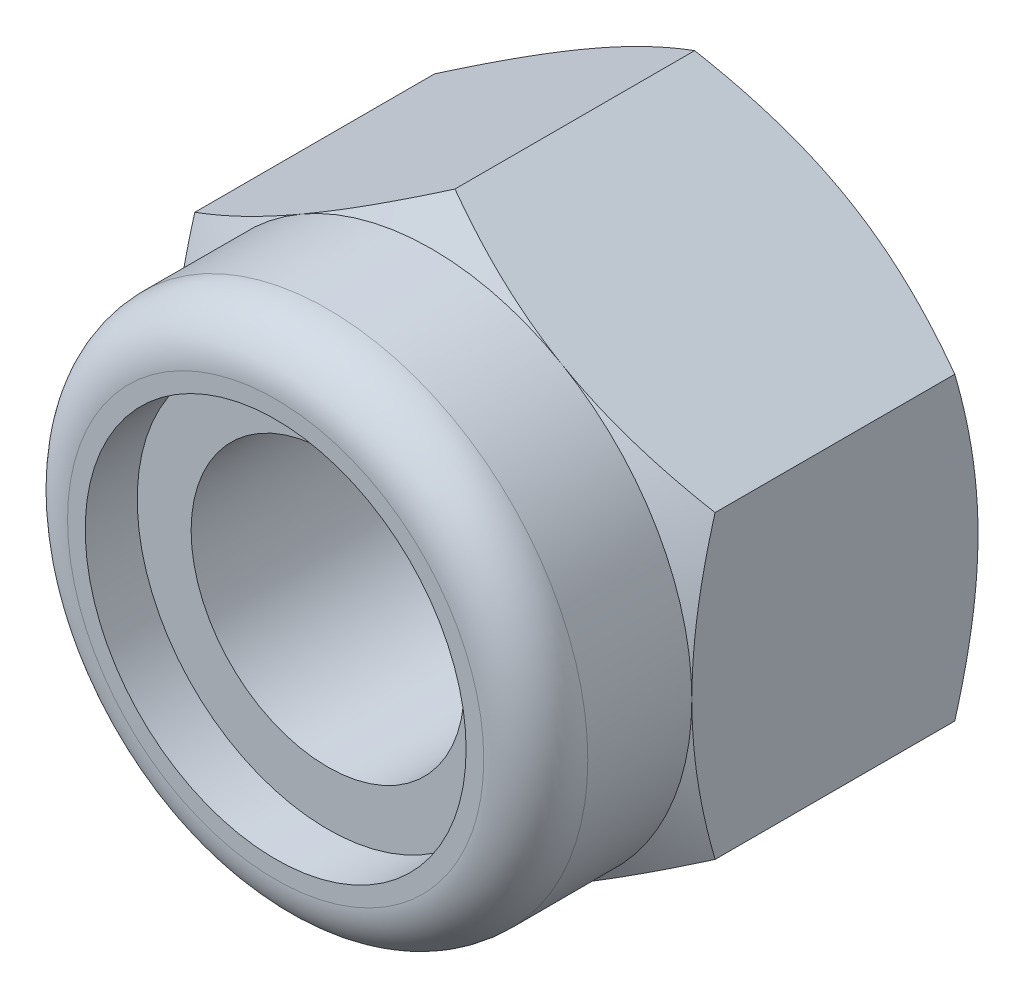
ISO-10303-21;
HEADER;
FILE_DESCRIPTION(('STEP AP214'),'2;1');
FILE_NAME('part.step','',(''),(''),'','','');
FILE_SCHEMA(('AUTOMOTIVE_DESIGN { 1 0 10303 214 1 1 1 1 }'));
ENDSEC;
DATA;
#1=APPLICATION_CONTEXT('core data for automotive mechanical design processes');
#2=APPLICATION_PROTOCOL_DEFINITION('international standard','automotive_design',2000,#1);
#3=PRODUCT_CONTEXT('',#1,'mechanical');
#4=PRODUCT('Part','Part','',(#3));
#5=PRODUCT_RELATED_PRODUCT_CATEGORY('part','',(#4));
#6=PRODUCT_DEFINITION_FORMATION('','',#4);
#7=PRODUCT_DEFINITION_CONTEXT('part definition',#1,'design');
#8=PRODUCT_DEFINITION('design','',#6,#7);
#9=PRODUCT_DEFINITION_SHAPE('','',#8);
#10=(LENGTH_UNIT() NAMED_UNIT(*) SI_UNIT(.MILLI.,.METRE.));
#11=(NAMED_UNIT(*) PLANE_ANGLE_UNIT() SI_UNIT($,.RADIAN.));
#12=(NAMED_UNIT(*) SI_UNIT($,.STERADIAN.) SOLID_ANGLE_UNIT());
#13=UNCERTAINTY_MEASURE_WITH_UNIT(LENGTH_MEASURE(1.E-05),#10,'distance_accuracy_value','');
#14=(GEOMETRIC_REPRESENTATION_CONTEXT(3) GLOBAL_UNCERTAINTY_ASSIGNED_CONTEXT((#13)) GLOBAL_UNIT_ASSIGNED_CONTEXT((#10,
#11,#12)) REPRESENTATION_CONTEXT('',''));
#15=CARTESIAN_POINT('',(0.,0.,0.));
#16=DIRECTION('',(0.,0.,1.));
#17=DIRECTION('',(1.,0.,0.));
#18=AXIS2_PLACEMENT_3D('',#15,#16,#17);
#19=CARTESIAN_POINT('',(0.,0.,-4.4));
#20=DIRECTION('',(0.,0.,1.));
#21=DIRECTION('',(1.,0.,0.));
#22=AXIS2_PLACEMENT_3D('',#19,#20,#21);
#23=CYLINDRICAL_SURFACE('',#22,2.1);
#24=CARTESIAN_POINT('',(0.,0.,1.6));
#25=DIRECTION('',(0.,0.,1.));
#26=DIRECTION('',(1.,0.,0.));
#27=AXIS2_PLACEMENT_3D('',#24,#25,#26);
#28=CIRCLE('',#27,2.1);
#29=CARTESIAN_POINT('',(2.1,0.,1.6));
#30=VERTEX_POINT('',#29);
#31=EDGE_CURVE('E272',#30,#30,#28,.T.);
#32=ORIENTED_EDGE('',*,*,#31,.T.);
#33=EDGE_LOOP('',(#32));
#34=FACE_BOUND('',#33,.T.);
#35=CARTESIAN_POINT('',(0.,0.,-4.09451698471612));
#36=DIRECTION('',(0.,0.,-1.));
#37=DIRECTION('',(-1.,0.,0.));
#38=AXIS2_PLACEMENT_3D('',#35,#36,#37);
#39=CIRCLE('',#38,2.1);
#40=CARTESIAN_POINT('',(-2.1,0.,-4.09451698471612));
#41=VERTEX_POINT('',#40);
#42=EDGE_CURVE('E39',#41,#41,#39,.F.);
#43=ORIENTED_EDGE('',*,*,#42,.F.);
#44=EDGE_LOOP('',(#43));
#45=FACE_BOUND('',#44,.T.);
#46=ADVANCED_FACE('F34',(#34,#45),#23,.F.);
#47=CARTESIAN_POINT('',(0.,4.61880215351701,-4.4));
#48=DIRECTION('',(0.,0.,-1.));
#49=DIRECTION('',(-1.,0.,0.));
#50=AXIS2_PLACEMENT_3D('',#47,#48,#49);
#51=PLANE('',#50);
#52=CARTESIAN_POINT('',(0.,0.,-4.4));
#53=DIRECTION('',(0.,0.,-1.));
#54=DIRECTION('',(-1.,0.,0.));
#55=AXIS2_PLACEMENT_3D('',#52,#53,#54);
#56=CIRCLE('',#55,4.);
#57=CARTESIAN_POINT('',(-4.,0.,-4.4));
#58=VERTEX_POINT('',#57);
#59=CARTESIAN_POINT('',(-2.,-3.46410161513775,-4.4));
#60=VERTEX_POINT('',#59);
#61=EDGE_CURVE('E144',#58,#60,#56,.F.);
#62=ORIENTED_EDGE('',*,*,#61,.F.);
#63=CARTESIAN_POINT('',(-2.,3.46410161513775,-4.4));
#64=VERTEX_POINT('',#63);
#65=EDGE_CURVE('E234',#64,#58,#56,.F.);
#66=ORIENTED_EDGE('',*,*,#65,.F.);
#67=CARTESIAN_POINT('',(2.,3.46410161513775,-4.4));
#68=VERTEX_POINT('',#67);
#69=EDGE_CURVE('E249',#68,#64,#56,.F.);
#70=ORIENTED_EDGE('',*,*,#69,.F.);
#71=CARTESIAN_POINT('',(0.,0.,-4.4));
#72=DIRECTION('',(0.,0.,1.));
#73=DIRECTION('',(1.,0.,0.));
#74=AXIS2_PLACEMENT_3D('',#71,#72,#73);
#75=CIRCLE('',#74,4.);
#76=CARTESIAN_POINT('',(4.,0.,-4.4));
#77=VERTEX_POINT('',#76);
#78=EDGE_CURVE('E206',#77,#68,#75,.T.);
#79=ORIENTED_EDGE('',*,*,#78,.F.);
#80=CARTESIAN_POINT('',(2.,-3.46410161513775,-4.4));
#81=VERTEX_POINT('',#80);
#82=EDGE_CURVE('E403',#81,#77,#56,.F.);
#83=ORIENTED_EDGE('',*,*,#82,.F.);
#84=EDGE_CURVE('E321',#60,#81,#56,.F.);
#85=ORIENTED_EDGE('',*,*,#84,.F.);
#86=EDGE_LOOP('',(#62,#66,#70,#79,#83,#85));
#87=FACE_BOUND('',#86,.T.);
#88=CARTESIAN_POINT('',(0.,0.,-4.4));
#89=DIRECTION('',(0.,0.,-1.));
#90=DIRECTION('',(-1.,0.,0.));
#91=AXIS2_PLACEMENT_3D('',#88,#89,#90);
#92=CIRCLE('',#91,2.5);
#93=CARTESIAN_POINT('',(-2.5,0.,-4.4));
#94=VERTEX_POINT('',#93);
#95=EDGE_CURVE('E250',#94,#94,#92,.F.);
#96=ORIENTED_EDGE('',*,*,#95,.T.);
#97=EDGE_LOOP('',(#96));
#98=FACE_BOUND('',#97,.T.);
#99=ADVANCED_FACE('F214',(#87,#98),#51,.T.);
#100=CARTESIAN_POINT('',(0.,4.61880215351701,-4.4));
#101=DIRECTION('',(-0.500000000000001,0.866025403784438,0.));
#102=DIRECTION('',(-0.866025403784438,-0.500000000000001,0.));
#103=AXIS2_PLACEMENT_3D('',#100,#101,#102);
#104=PLANE('',#103);
#105=DIRECTION('',(0.,0.,1.));
#106=VECTOR('',#105,1.);
#107=CARTESIAN_POINT('',(-4.,2.3094010767585,-4.4));
#108=LINE('',#107,#106);
#109=CARTESIAN_POINT('',(-4.,2.30940107675851,-4.04273441009183));
#110=VERTEX_POINT('',#109);
#111=CARTESIAN_POINT('',(-4.,2.3094010767585,-0.357265589908164));
#112=VERTEX_POINT('',#111);
#113=EDGE_CURVE('E245',#110,#112,#108,.T.);
#114=ORIENTED_EDGE('',*,*,#113,.T.);
#115=CARTESIAN_POINT('',(-4.0002,2.30928560670466,-0.357332259074767));
#116=CARTESIAN_POINT('',(-3.82442084967677,2.4107717464617,-0.298717873648283));
#117=CARTESIAN_POINT('',(-3.64712438367362,2.51313390883499,-0.245410321462263));
#118=CARTESIAN_POINT('',(-3.28946140682429,2.71963072479811,-0.152361670746403));
#119=CARTESIAN_POINT('',(-3.10908854102985,2.82376904741904,-0.112653489029704));
#120=CARTESIAN_POINT('',(-2.75057818129721,3.03075510011795,-0.0508422152802782));
#121=CARTESIAN_POINT('',(-2.57249584706486,3.13357098372492,-0.0283277315228881));
#122=CARTESIAN_POINT('',(-2.21549328283349,3.33968651028528,-0.001450623146581));
#123=CARTESIAN_POINT('',(-2.0365743503559,3.44298540411434,0.00293425857305767));
#124=CARTESIAN_POINT('',(-1.70225715780327,3.63600352522932,-0.00619007293996943));
#125=CARTESIAN_POINT('',(-1.54680884001293,3.72575165335065,-0.0174589539879935));
#126=CARTESIAN_POINT('',(-1.23692494436494,3.90466320392054,-0.0531739907981931));
#127=CARTESIAN_POINT('',(-1.08249043825587,3.99382600759478,-0.0776323457115336));
#128=CARTESIAN_POINT('',(-0.771967672225422,4.17310641015197,-0.138776064919291));
#129=CARTESIAN_POINT('',(-0.615918711936898,4.26320131938131,-0.175720603654865));
#130=CARTESIAN_POINT('',(-0.306148164596161,4.44204742827551,-0.259570072548029));
#131=CARTESIAN_POINT('',(-0.152422609226221,4.53080091904966,-0.306455302212742));
#132=CARTESIAN_POINT('',(0.000199999999999515,4.61891762357085,-0.35733225907477));
#133=B_SPLINE_CURVE_WITH_KNOTS('',3,(#115,#116,#117,#118,#119,#120,#121,#122,#123,#124,#125,
#126,#127,#128,#129,#130,#131,#132),.UNSPECIFIED.,.F.,.F.,(4,2,2,2,2,2,2,2,4),(0.,
0.634047835695966,1.26961969224543,1.88946157213122,2.50854226669297,3.04757825393386,
3.58711366126904,4.13861653143764,4.68903648037743),.UNSPECIFIED.);
#134=CARTESIAN_POINT('',(-2.,3.46410161513775,0.));
#135=VERTEX_POINT('',#134);
#136=EDGE_CURVE('E59',#112,#135,#133,.T.);
#137=ORIENTED_EDGE('',*,*,#136,.T.);
#138=CARTESIAN_POINT('',(0.,4.61880215351701,-0.357265589908166));
#139=VERTEX_POINT('',#138);
#140=EDGE_CURVE('E197',#135,#139,#133,.T.);
#141=ORIENTED_EDGE('',*,*,#140,.T.);
#142=DIRECTION('',(0.,0.,1.));
#143=VECTOR('',#142,1.);
#144=CARTESIAN_POINT('',(0.,4.61880215351701,-4.4));
#145=LINE('',#144,#143);
#146=CARTESIAN_POINT('',(0.,4.61880215351701,-4.04273441009183));
#147=VERTEX_POINT('',#146);
#148=EDGE_CURVE('E231',#147,#139,#145,.T.);
#149=ORIENTED_EDGE('',*,*,#148,.F.);
#150=CARTESIAN_POINT('',(-4.0002,2.30928560670466,-4.04266774092523));
#151=CARTESIAN_POINT('',(-3.82442084967677,2.4107717464617,-4.10128212635172));
#152=CARTESIAN_POINT('',(-3.64712438367362,2.51313390883499,-4.15458967853774));
#153=CARTESIAN_POINT('',(-3.28946140682429,2.71963072479811,-4.2476383292536));
#154=CARTESIAN_POINT('',(-3.10908854102985,2.82376904741904,-4.2873465109703));
#155=CARTESIAN_POINT('',(-2.75057818129721,3.03075510011795,-4.34915778471972));
#156=CARTESIAN_POINT('',(-2.57249584706486,3.13357098372492,-4.37167226847711));
#157=CARTESIAN_POINT('',(-2.21549328283349,3.33968651028528,-4.39854937685342));
#158=CARTESIAN_POINT('',(-2.0365743503559,3.44298540411434,-4.40293425857306));
#159=CARTESIAN_POINT('',(-1.70225715780327,3.63600352522932,-4.39380992706003));
#160=CARTESIAN_POINT('',(-1.54680884001293,3.72575165335065,-4.38254104601201));
#161=CARTESIAN_POINT('',(-1.23692494436494,3.90466320392054,-4.34682600920181));
#162=CARTESIAN_POINT('',(-1.08249043825587,3.99382600759479,-4.32236765428847));
#163=CARTESIAN_POINT('',(-0.771967672225422,4.17310641015197,-4.26122393508071));
#164=CARTESIAN_POINT('',(-0.615918711936898,4.26320131938131,-4.22427939634514));
#165=CARTESIAN_POINT('',(-0.306148164596161,4.44204742827551,-4.14042992745197));
#166=CARTESIAN_POINT('',(-0.152422609226221,4.53080091904966,-4.09354469778726));
#167=CARTESIAN_POINT('',(0.00019999999999951,4.61891762357085,-4.04266774092523));
#168=B_SPLINE_CURVE_WITH_KNOTS('',3,(#150,#151,#152,#153,#154,#155,#156,#157,#158,#159,#160,
#161,#162,#163,#164,#165,#166,#167),.UNSPECIFIED.,.F.,.F.,(4,2,2,2,2,2,2,2,4),(0.,
0.634047835695967,1.26961969224543,1.88946157213122,2.50854226669297,3.04757825393386,
3.58711366126904,4.13861653143764,4.68903648037744),.UNSPECIFIED.);
#169=EDGE_CURVE('E247',#64,#147,#168,.T.);
#170=ORIENTED_EDGE('',*,*,#169,.F.);
#171=EDGE_CURVE('E226',#110,#64,#168,.T.);
#172=ORIENTED_EDGE('',*,*,#171,.F.);
#173=EDGE_LOOP('',(#114,#137,#141,#149,#170,#172));
#174=FACE_BOUND('',#173,.T.);
#175=ADVANCED_FACE('F36',(#174),#104,.T.);
#176=CARTESIAN_POINT('',(4.,2.3094010767585,-4.4));
#177=DIRECTION('',(0.500000000000001,0.866025403784438,0.));
#178=DIRECTION('',(-0.866025403784438,0.500000000000001,0.));
#179=AXIS2_PLACEMENT_3D('',#176,#177,#178);
#180=PLANE('',#179);
#181=ORIENTED_EDGE('',*,*,#148,.T.);
#182=CARTESIAN_POINT('',(-0.000200000000000428,4.61891762357085,-0.35733225907477));
#183=CARTESIAN_POINT('',(0.175579150323228,4.51743148381381,-0.298717873648285));
#184=CARTESIAN_POINT('',(0.352875616326381,4.41506932144052,-0.245410321462265));
#185=CARTESIAN_POINT('',(0.710538593175707,4.2085725054774,-0.152361670746405));
#186=CARTESIAN_POINT('',(0.890911458970151,4.10443418285647,-0.112653489029705));
#187=CARTESIAN_POINT('',(1.24942181870279,3.89744813015756,-0.0508422152802789));
#188=CARTESIAN_POINT('',(1.42750415293514,3.79463224655059,-0.0283277315228883));
#189=CARTESIAN_POINT('',(1.78450671716651,3.58851671999023,-0.001450623146581));
#190=CARTESIAN_POINT('',(1.9634256496441,3.48521782616117,0.00293425857305746));
#191=CARTESIAN_POINT('',(2.29774284219673,3.29219970504619,-0.00619007293996948));
#192=CARTESIAN_POINT('',(2.45319115998707,3.20245157692486,-0.0174589539879932));
#193=CARTESIAN_POINT('',(2.76307505563506,3.02354002635497,-0.053173990798192));
#194=CARTESIAN_POINT('',(2.91750956174413,2.93437722268072,-0.077632345711532));
#195=CARTESIAN_POINT('',(3.22803232777458,2.75509682012354,-0.138776064919289));
#196=CARTESIAN_POINT('',(3.3840812880631,2.6650019108942,-0.175720603654863));
#197=CARTESIAN_POINT('',(3.69385183540384,2.486155802,-0.259570072548027));
#198=CARTESIAN_POINT('',(3.84757739077378,2.39740231122584,-0.306455302212741));
#199=CARTESIAN_POINT('',(4.0002,2.30928560670466,-0.357332259074768));
#200=B_SPLINE_CURVE_WITH_KNOTS('',3,(#182,#183,#184,#185,#186,#187,#188,#189,#190,#191,#192,
#193,#194,#195,#196,#197,#198,#199),.UNSPECIFIED.,.F.,.F.,(4,2,2,2,2,2,2,2,4),(0.,
0.634047835695967,1.26961969224544,1.88946157213122,2.50854226669297,3.04757825393386,
3.58711366126904,4.13861653143764,4.68903648037744),.UNSPECIFIED.);
#201=CARTESIAN_POINT('',(2.,3.46410161513775,0.));
#202=VERTEX_POINT('',#201);
#203=EDGE_CURVE('E205',#139,#202,#200,.T.);
#204=ORIENTED_EDGE('',*,*,#203,.T.);
#205=CARTESIAN_POINT('',(4.,2.30940107675851,-0.357265589908166));
#206=VERTEX_POINT('',#205);
#207=EDGE_CURVE('E198',#202,#206,#200,.T.);
#208=ORIENTED_EDGE('',*,*,#207,.T.);
#209=DIRECTION('',(0.,0.,1.));
#210=VECTOR('',#209,1.);
#211=CARTESIAN_POINT('',(4.,2.3094010767585,-4.4));
#212=LINE('',#211,#210);
#213=CARTESIAN_POINT('',(4.,2.30940107675851,-4.04273441009183));
#214=VERTEX_POINT('',#213);
#215=EDGE_CURVE('E235',#214,#206,#212,.T.);
#216=ORIENTED_EDGE('',*,*,#215,.F.);
#217=CARTESIAN_POINT('',(-0.000200000000000428,4.61891762357085,-4.04266774092523));
#218=CARTESIAN_POINT('',(0.175579150323228,4.51743148381381,-4.10128212635172));
#219=CARTESIAN_POINT('',(0.352875616326381,4.41506932144052,-4.15458967853774));
#220=CARTESIAN_POINT('',(0.710538593175707,4.2085725054774,-4.2476383292536));
#221=CARTESIAN_POINT('',(0.890911458970151,4.10443418285647,-4.2873465109703));
#222=CARTESIAN_POINT('',(1.24942181870279,3.89744813015756,-4.34915778471972));
#223=CARTESIAN_POINT('',(1.42750415293514,3.79463224655059,-4.37167226847711));
#224=CARTESIAN_POINT('',(1.78450671716651,3.58851671999023,-4.39854937685342));
#225=CARTESIAN_POINT('',(1.9634256496441,3.48521782616117,-4.40293425857306));
#226=CARTESIAN_POINT('',(2.29774284219673,3.29219970504619,-4.39380992706003));
#227=CARTESIAN_POINT('',(2.45319115998707,3.20245157692486,-4.38254104601201));
#228=CARTESIAN_POINT('',(2.76307505563506,3.02354002635497,-4.34682600920181));
#229=CARTESIAN_POINT('',(2.91750956174413,2.93437722268072,-4.32236765428847));
#230=CARTESIAN_POINT('',(3.22803232777458,2.75509682012354,-4.26122393508071));
#231=CARTESIAN_POINT('',(3.3840812880631,2.6650019108942,-4.22427939634514));
#232=CARTESIAN_POINT('',(3.69385183540384,2.486155802,-4.14042992745197));
#233=CARTESIAN_POINT('',(3.84757739077378,2.39740231122584,-4.09354469778726));
#234=CARTESIAN_POINT('',(4.0002,2.30928560670466,-4.04266774092523));
#235=B_SPLINE_CURVE_WITH_KNOTS('',3,(#217,#218,#219,#220,#221,#222,#223,#224,#225,#226,#227,
#228,#229,#230,#231,#232,#233,#234),.UNSPECIFIED.,.F.,.F.,(4,2,2,2,2,2,2,2,4),(0.,
0.634047835695967,1.26961969224544,1.88946157213122,2.50854226669297,3.04757825393386,
3.58711366126904,4.13861653143764,4.68903648037744),.UNSPECIFIED.);
#236=EDGE_CURVE('E218',#68,#214,#235,.T.);
#237=ORIENTED_EDGE('',*,*,#236,.F.);
#238=EDGE_CURVE('E224',#147,#68,#235,.T.);
#239=ORIENTED_EDGE('',*,*,#238,.F.);
#240=EDGE_LOOP('',(#181,#204,#208,#216,#237,#239));
#241=FACE_BOUND('',#240,.T.);
#242=ADVANCED_FACE('F208',(#241),#180,.T.);
#243=CARTESIAN_POINT('',(4.,2.3094010767585,-4.4));
#244=DIRECTION('',(-1.,0.,0.));
#245=DIRECTION('',(0.,0.,1.));
#246=AXIS2_PLACEMENT_3D('',#243,#244,#245);
#247=PLANE('',#246);
#248=CARTESIAN_POINT('',(4.,-6.12487198995892,-1.91410682124064));
#249=CARTESIAN_POINT('',(4.,-5.94924937038676,-1.8292362707669));
#250=CARTESIAN_POINT('',(4.,-5.77321152095286,-1.7452094038074));
#251=CARTESIAN_POINT('',(4.,-5.42008084777954,-1.57932514679717));
#252=CARTESIAN_POINT('',(4.,-5.24298784779928,-1.49746813236723));
#253=CARTESIAN_POINT('',(4.,-4.88656571686334,-1.33597446305856));
#254=CARTESIAN_POINT('',(4.,-4.70722958889362,-1.25635319506304));
#255=CARTESIAN_POINT('',(4.,-4.34708334747263,-1.1005305854203));
#256=CARTESIAN_POINT('',(4.,-4.16627331143537,-1.02432906550802));
#257=CARTESIAN_POINT('',(4.,-3.80064706744977,-0.875350650394364));
#258=CARTESIAN_POINT('',(4.,-3.6158089282277,-0.802627284215847));
#259=CARTESIAN_POINT('',(4.,-3.24395246794968,-0.66287623095942));
#260=CARTESIAN_POINT('',(4.,-3.05693390695801,-0.595849177566505));
#261=CARTESIAN_POINT('',(4.,-2.6808031825377,-0.469291748430882));
#262=CARTESIAN_POINT('',(4.,-2.49169643712848,-0.409745434783838));
#263=CARTESIAN_POINT('',(4.,-2.11079454635851,-0.300083356544506));
#264=CARTESIAN_POINT('',(4.,-1.91900027185749,-0.249964609676752));
#265=CARTESIAN_POINT('',(4.,-1.532592326982,-0.161590794954041));
#266=CARTESIAN_POINT('',(4.,-1.3379779203165,-0.12333888595654));
#267=CARTESIAN_POINT('',(4.,-0.946402725872553,-0.0612742359223427));
#268=CARTESIAN_POINT('',(4.,-0.749441936019773,-0.0374615076516982));
#269=CARTESIAN_POINT('',(4.,-0.355451989627942,-0.0063818131494358));
#270=CARTESIAN_POINT('',(4.,-0.158431311094011,0.000989900761041694));
#271=CARTESIAN_POINT('',(4.,0.235472085607469,-0.00120406637479522));
#272=CARTESIAN_POINT('',(4.,0.432354826312206,-0.0107653508153502));
#273=CARTESIAN_POINT('',(4.,0.768560635225517,-0.0408787346135905));
#274=CARTESIAN_POINT('',(4.,0.908254618381819,-0.0575092960439099));
#275=CARTESIAN_POINT('',(4.,1.18656349063497,-0.0982134103466921));
#276=CARTESIAN_POINT('',(4.,1.32517820601013,-0.122288137058447));
#277=CARTESIAN_POINT('',(4.,1.73929045452969,-0.204415070950231));
#278=CARTESIAN_POINT('',(4.,2.01284690528722,-0.272348886425153));
#279=CARTESIAN_POINT('',(4.,2.42218253014523,-0.389516359317204));
#280=CARTESIAN_POINT('',(4.,2.56009536361538,-0.431713941811637));
#281=CARTESIAN_POINT('',(4.,2.83448159101403,-0.520284580227763));
#282=CARTESIAN_POINT('',(4.,2.97095590623557,-0.566654756186912));
#283=CARTESIAN_POINT('',(4.,3.2418944051634,-0.662605699180286));
#284=CARTESIAN_POINT('',(4.,3.37636557946838,-0.7121669257535));
#285=CARTESIAN_POINT('',(4.,3.64426461152914,-0.814198353790703));
#286=CARTESIAN_POINT('',(4.,3.77769202239387,-0.86666973096337));
#287=CARTESIAN_POINT('',(4.,3.91063698986684,-0.920309006541793));
#288=B_SPLINE_CURVE_WITH_KNOTS('',3,(#248,#249,#250,#251,#252,#253,#254,#255,#256,#257,#258,
#259,#260,#261,#262,#263,#264,#265,#266,#267,#268,#269,#270,#271,#272,#273,#274,#275,#276,#277,
#278,#279,#280,#281,#282,#283,#284,#285,#286,#287),.UNSPECIFIED.,.F.,.F.,(4,2,2,2,2,2,2,2,2,2,2,
2,2,2,2,2,2,2,2,4),(0.,0.58517179253227,1.17044423059927,1.7590659464599,2.34765694284827,
2.94347400997483,3.53935727210689,4.13394864697601,4.72835161391471,5.32291267067845,
5.91747425310813,6.50823685854037,7.09884609659886,7.52068140825521,7.9425832713084,
8.78701491359829,9.21965281897689,9.65199437116297,10.0819024146297,10.5119854255247),.UNSPECIFIED.);
#289=CARTESIAN_POINT('',(4.,-2.30940107675851,-0.357265589908166));
#290=VERTEX_POINT('',#289);
#291=CARTESIAN_POINT('',(4.,0.,0.));
#292=VERTEX_POINT('',#291);
#293=EDGE_CURVE('E187',#290,#292,#288,.T.);
#294=ORIENTED_EDGE('',*,*,#293,.F.);
#295=DIRECTION('',(0.,0.,1.));
#296=VECTOR('',#295,1.);
#297=CARTESIAN_POINT('',(4.,-2.30940107675851,-4.4));
#298=LINE('',#297,#296);
#299=CARTESIAN_POINT('',(4.,-2.30940107675851,-4.04273441009183));
#300=VERTEX_POINT('',#299);
#301=EDGE_CURVE('E238',#300,#290,#298,.T.);
#302=ORIENTED_EDGE('',*,*,#301,.F.);
#303=CARTESIAN_POINT('',(4.,-6.12487198995892,-2.48589317875936));
#304=CARTESIAN_POINT('',(4.,-5.94924937038676,-2.5707637292331));
#305=CARTESIAN_POINT('',(4.,-5.77321152095286,-2.6547905961926));
#306=CARTESIAN_POINT('',(4.,-5.42008084777954,-2.82067485320283));
#307=CARTESIAN_POINT('',(4.,-5.24298784779927,-2.90253186763277));
#308=CARTESIAN_POINT('',(4.,-4.88656571686334,-3.06402553694144));
#309=CARTESIAN_POINT('',(4.,-4.70722958889362,-3.14364680493696));
#310=CARTESIAN_POINT('',(4.,-4.34708334747263,-3.2994694145797));
#311=CARTESIAN_POINT('',(4.,-4.16627331143537,-3.37567093449198));
#312=CARTESIAN_POINT('',(4.,-3.80064706744977,-3.52464934960564));
#313=CARTESIAN_POINT('',(4.,-3.6158089282277,-3.59737271578415));
#314=CARTESIAN_POINT('',(4.,-3.24395246794968,-3.73712376904058));
#315=CARTESIAN_POINT('',(4.,-3.05693390695801,-3.8041508224335));
#316=CARTESIAN_POINT('',(4.,-2.6808031825377,-3.93070825156912));
#317=CARTESIAN_POINT('',(4.,-2.49169643712848,-3.99025456521616));
#318=CARTESIAN_POINT('',(4.,-2.11079454635851,-4.09991664345549));
#319=CARTESIAN_POINT('',(4.,-1.91900027185749,-4.15003539032325));
#320=CARTESIAN_POINT('',(4.,-1.532592326982,-4.23840920504596));
#321=CARTESIAN_POINT('',(4.,-1.3379779203165,-4.27666111404346));
#322=CARTESIAN_POINT('',(4.,-0.946402725872554,-4.33872576407766));
#323=CARTESIAN_POINT('',(4.,-0.749441936019774,-4.3625384923483));
#324=CARTESIAN_POINT('',(4.,-0.355451989627942,-4.39361818685056));
#325=CARTESIAN_POINT('',(4.,-0.158431311094011,-4.40098990076104));
#326=CARTESIAN_POINT('',(4.,0.235472085607469,-4.39879593362521));
#327=CARTESIAN_POINT('',(4.,0.432354826312205,-4.38923464918465));
#328=CARTESIAN_POINT('',(4.,0.768560635225517,-4.35912126538641));
#329=CARTESIAN_POINT('',(4.,0.908254618381819,-4.34249070395609));
#330=CARTESIAN_POINT('',(4.,1.18656349063497,-4.30178658965331));
#331=CARTESIAN_POINT('',(4.,1.32517820601013,-4.27771186294155));
#332=CARTESIAN_POINT('',(4.,1.73929045452969,-4.19558492904977));
#333=CARTESIAN_POINT('',(4.,2.01284690528722,-4.12765111357485));
#334=CARTESIAN_POINT('',(4.,2.42218253014524,-4.0104836406828));
#335=CARTESIAN_POINT('',(4.,2.56009536361538,-3.96828605818836));
#336=CARTESIAN_POINT('',(4.,2.83448159101403,-3.87971541977224));
#337=CARTESIAN_POINT('',(4.,2.97095590623557,-3.83334524381309));
#338=CARTESIAN_POINT('',(4.,3.2418944051634,-3.73739430081971));
#339=CARTESIAN_POINT('',(4.,3.37636557946838,-3.6878330742465));
#340=CARTESIAN_POINT('',(4.,3.64426461152914,-3.5858016462093));
#341=CARTESIAN_POINT('',(4.,3.77769202239387,-3.53333026903663));
#342=CARTESIAN_POINT('',(4.,3.91063698986684,-3.47969099345821));
#343=B_SPLINE_CURVE_WITH_KNOTS('',3,(#303,#304,#305,#306,#307,#308,#309,#310,#311,#312,#313,
#314,#315,#316,#317,#318,#319,#320,#321,#322,#323,#324,#325,#326,#327,#328,#329,#330,#331,#332,
#333,#334,#335,#336,#337,#338,#339,#340,#341,#342),.UNSPECIFIED.,.F.,.F.,(4,2,2,2,2,2,2,2,2,2,2,
2,2,2,2,2,2,2,2,4),(0.,0.585171792532271,1.17044423059927,1.7590659464599,2.34765694284827,
2.94347400997484,3.53935727210689,4.13394864697601,4.72835161391471,5.32291267067845,
5.91747425310813,6.50823685854037,7.09884609659886,7.52068140825521,7.9425832713084,
8.78701491359829,9.21965281897689,9.65199437116297,10.0819024146297,10.5119854255247),.UNSPECIFIED.);
#344=EDGE_CURVE('E371',#300,#77,#343,.T.);
#345=ORIENTED_EDGE('',*,*,#344,.T.);
#346=EDGE_CURVE('E225',#77,#214,#343,.T.);
#347=ORIENTED_EDGE('',*,*,#346,.T.);
#348=ORIENTED_EDGE('',*,*,#215,.T.);
#349=EDGE_CURVE('E196',#292,#206,#288,.T.);
#350=ORIENTED_EDGE('',*,*,#349,.F.);
#351=EDGE_LOOP('',(#294,#302,#345,#347,#348,#350));
#352=FACE_BOUND('',#351,.T.);
#353=ADVANCED_FACE('F212',(#352),#247,.F.);
#354=CARTESIAN_POINT('',(0.,-4.61880215351701,-4.4));
#355=DIRECTION('',(0.500000000000001,-0.866025403784438,0.));
#356=DIRECTION('',(0.866025403784438,0.500000000000001,0.));
#357=AXIS2_PLACEMENT_3D('',#354,#355,#356);
#358=PLANE('',#357);
#359=ORIENTED_EDGE('',*,*,#301,.T.);
#360=CARTESIAN_POINT('',(4.0002,-2.30928560670467,-0.35733225907477));
#361=CARTESIAN_POINT('',(3.82442084967677,-2.41077174646171,-0.298717873648285));
#362=CARTESIAN_POINT('',(3.64712438367362,-2.513133908835,-0.245410321462265));
#363=CARTESIAN_POINT('',(3.28946140682429,-2.71963072479812,-0.152361670746405));
#364=CARTESIAN_POINT('',(3.10908854102985,-2.82376904741905,-0.112653489029706));
#365=CARTESIAN_POINT('',(2.75057818129721,-3.03075510011796,-0.0508422152802809));
#366=CARTESIAN_POINT('',(2.57249584706486,-3.13357098372492,-0.0283277315228906));
#367=CARTESIAN_POINT('',(2.21549328283349,-3.33968651028529,-0.00145062314658372));
#368=CARTESIAN_POINT('',(2.0365743503559,-3.44298540411435,0.00293425857305477));
#369=CARTESIAN_POINT('',(1.70225715780327,-3.63600352522933,-0.00619007293997277));
#370=CARTESIAN_POINT('',(1.54680884001293,-3.72575165335065,-0.0174589539879971));
#371=CARTESIAN_POINT('',(1.23692494436494,-3.90466320392055,-0.0531739907981968));
#372=CARTESIAN_POINT('',(1.08249043825587,-3.99382600759479,-0.0776323457115372));
#373=CARTESIAN_POINT('',(0.771967672225421,-4.17310641015198,-0.138776064919294));
#374=CARTESIAN_POINT('',(0.615918711936897,-4.26320131938132,-0.175720603654869));
#375=CARTESIAN_POINT('',(0.30614816459616,-4.44204742827551,-0.259570072548033));
#376=CARTESIAN_POINT('',(0.152422609226221,-4.53080091904967,-0.306455302212746));
#377=CARTESIAN_POINT('',(-0.000199999999999587,-4.61891762357085,-0.357332259074774));
#378=B_SPLINE_CURVE_WITH_KNOTS('',3,(#360,#361,#362,#363,#364,#365,#366,#367,#368,#369,#370,
#371,#372,#373,#374,#375,#376,#377),.UNSPECIFIED.,.F.,.F.,(4,2,2,2,2,2,2,2,4),(0.,
0.634047835695967,1.26961969224544,1.88946157213122,2.50854226669297,3.04757825393386,
3.58711366126904,4.13861653143764,4.68903648037743),.UNSPECIFIED.);
#379=CARTESIAN_POINT('',(2.,-3.46410161513775,0.));
#380=VERTEX_POINT('',#379);
#381=EDGE_CURVE('E365',#290,#380,#378,.T.);
#382=ORIENTED_EDGE('',*,*,#381,.T.);
#383=CARTESIAN_POINT('',(0.,-4.61880215351701,-0.357265589908166));
#384=VERTEX_POINT('',#383);
#385=EDGE_CURVE('E181',#380,#384,#378,.T.);
#386=ORIENTED_EDGE('',*,*,#385,.T.);
#387=DIRECTION('',(0.,0.,1.));
#388=VECTOR('',#387,1.);
#389=CARTESIAN_POINT('',(0.,-4.61880215351701,-4.4));
#390=LINE('',#389,#388);
#391=CARTESIAN_POINT('',(0.,-4.61880215351701,-4.04273441009183));
#392=VERTEX_POINT('',#391);
#393=EDGE_CURVE('E241',#392,#384,#390,.T.);
#394=ORIENTED_EDGE('',*,*,#393,.F.);
#395=CARTESIAN_POINT('',(4.0002,-2.30928560670467,-4.04266774092523));
#396=CARTESIAN_POINT('',(3.82442084967677,-2.41077174646171,-4.10128212635172));
#397=CARTESIAN_POINT('',(3.64712438367362,-2.513133908835,-4.15458967853773));
#398=CARTESIAN_POINT('',(3.28946140682429,-2.71963072479812,-4.24763832925359));
#399=CARTESIAN_POINT('',(3.10908854102985,-2.82376904741905,-4.28734651097029));
#400=CARTESIAN_POINT('',(2.75057818129721,-3.03075510011796,-4.34915778471972));
#401=CARTESIAN_POINT('',(2.57249584706486,-3.13357098372492,-4.37167226847711));
#402=CARTESIAN_POINT('',(2.21549328283349,-3.33968651028529,-4.39854937685342));
#403=CARTESIAN_POINT('',(2.0365743503559,-3.44298540411435,-4.40293425857306));
#404=CARTESIAN_POINT('',(1.70225715780327,-3.63600352522933,-4.39380992706003));
#405=CARTESIAN_POINT('',(1.54680884001293,-3.72575165335065,-4.382541046012));
#406=CARTESIAN_POINT('',(1.23692494436494,-3.90466320392055,-4.3468260092018));
#407=CARTESIAN_POINT('',(1.08249043825587,-3.99382600759479,-4.32236765428846));
#408=CARTESIAN_POINT('',(0.771967672225421,-4.17310641015198,-4.26122393508071));
#409=CARTESIAN_POINT('',(0.615918711936897,-4.26320131938132,-4.22427939634513));
#410=CARTESIAN_POINT('',(0.30614816459616,-4.44204742827551,-4.14042992745197));
#411=CARTESIAN_POINT('',(0.152422609226221,-4.53080091904967,-4.09354469778725));
#412=CARTESIAN_POINT('',(-0.000199999999999882,-4.61891762357085,-4.04266774092523));
#413=B_SPLINE_CURVE_WITH_KNOTS('',3,(#395,#396,#397,#398,#399,#400,#401,#402,#403,#404,#405,
#406,#407,#408,#409,#410,#411,#412),.UNSPECIFIED.,.F.,.F.,(4,2,2,2,2,2,2,2,4),(0.,
0.634047835695967,1.26961969224544,1.88946157213122,2.50854226669297,3.04757825393386,
3.58711366126904,4.13861653143764,4.68903648037743),.UNSPECIFIED.);
#414=EDGE_CURVE('E343',#81,#392,#413,.T.);
#415=ORIENTED_EDGE('',*,*,#414,.F.);
#416=EDGE_CURVE('E367',#300,#81,#413,.T.);
#417=ORIENTED_EDGE('',*,*,#416,.F.);
#418=EDGE_LOOP('',(#359,#382,#386,#394,#415,#417));
#419=FACE_BOUND('',#418,.T.);
#420=ADVANCED_FACE('F350',(#419),#358,.T.);
#421=CARTESIAN_POINT('',(-4.,-2.30940107675851,-4.4));
#422=DIRECTION('',(-0.500000000000001,-0.866025403784438,0.));
#423=DIRECTION('',(0.866025403784438,-0.500000000000001,0.));
#424=AXIS2_PLACEMENT_3D('',#421,#422,#423);
#425=PLANE('',#424);
#426=ORIENTED_EDGE('',*,*,#393,.T.);
#427=CARTESIAN_POINT('',(0.000200000000000265,-4.61891762357085,-0.357332259074774));
#428=CARTESIAN_POINT('',(-0.175579150323228,-4.51743148381381,-0.298717873648289));
#429=CARTESIAN_POINT('',(-0.352875616326381,-4.41506932144052,-0.245410321462269));
#430=CARTESIAN_POINT('',(-0.710538593175708,-4.2085725054774,-0.152361670746408));
#431=CARTESIAN_POINT('',(-0.890911458970153,-4.10443418285647,-0.112653489029708));
#432=CARTESIAN_POINT('',(-1.24942181870279,-3.89744813015757,-0.0508422152802826));
#433=CARTESIAN_POINT('',(-1.42750415293515,-3.7946322465506,-0.0283277315228921));
#434=CARTESIAN_POINT('',(-1.78450671716651,-3.58851671999023,-0.00145062314658448));
#435=CARTESIAN_POINT('',(-1.9634256496441,-3.48521782616117,0.00293425857305446));
#436=CARTESIAN_POINT('',(-2.29774284219674,-3.29219970504619,-0.00619007293997248));
#437=CARTESIAN_POINT('',(-2.45319115998707,-3.20245157692487,-0.0174589539879966));
#438=CARTESIAN_POINT('',(-2.76307505563506,-3.02354002635497,-0.0531739907981955));
#439=CARTESIAN_POINT('',(-2.91750956174413,-2.93437722268073,-0.0776323457115353));
#440=CARTESIAN_POINT('',(-3.22803232777458,-2.75509682012354,-0.138776064919292));
#441=CARTESIAN_POINT('',(-3.3840812880631,-2.6650019108942,-0.175720603654866));
#442=CARTESIAN_POINT('',(-3.69385183540384,-2.48615580200001,-0.25957007254803));
#443=CARTESIAN_POINT('',(-3.84757739077378,-2.39740231122585,-0.306455302212743));
#444=CARTESIAN_POINT('',(-4.0002,-2.30928560670467,-0.35733225907477));
#445=B_SPLINE_CURVE_WITH_KNOTS('',3,(#427,#428,#429,#430,#431,#432,#433,#434,#435,#436,#437,
#438,#439,#440,#441,#442,#443,#444),.UNSPECIFIED.,.F.,.F.,(4,2,2,2,2,2,2,2,4),(0.,
0.634047835695968,1.26961969224544,1.88946157213123,2.50854226669298,3.04757825393386,
3.58711366126904,4.13861653143764,4.68903648037743),.UNSPECIFIED.);
#446=CARTESIAN_POINT('',(-2.,-3.46410161513775,0.));
#447=VERTEX_POINT('',#446);
#448=EDGE_CURVE('E150',#384,#447,#445,.T.);
#449=ORIENTED_EDGE('',*,*,#448,.T.);
#450=CARTESIAN_POINT('',(-4.,-2.30940107675851,-0.357265589908166));
#451=VERTEX_POINT('',#450);
#452=EDGE_CURVE('E141',#447,#451,#445,.T.);
#453=ORIENTED_EDGE('',*,*,#452,.T.);
#454=DIRECTION('',(0.,0.,1.));
#455=VECTOR('',#454,1.);
#456=CARTESIAN_POINT('',(-4.,-2.30940107675851,-4.4));
#457=LINE('',#456,#455);
#458=CARTESIAN_POINT('',(-4.,-2.30940107675851,-4.04273441009183));
#459=VERTEX_POINT('',#458);
#460=EDGE_CURVE('E149',#459,#451,#457,.T.);
#461=ORIENTED_EDGE('',*,*,#460,.F.);
#462=CARTESIAN_POINT('',(0.00020000000000025,-4.61891762357085,-4.04266774092523));
#463=CARTESIAN_POINT('',(-0.175579150323228,-4.51743148381381,-4.10128212635171));
#464=CARTESIAN_POINT('',(-0.352875616326382,-4.41506932144052,-4.15458967853773));
#465=CARTESIAN_POINT('',(-0.710538593175708,-4.2085725054774,-4.24763832925359));
#466=CARTESIAN_POINT('',(-0.890911458970153,-4.10443418285647,-4.28734651097029));
#467=CARTESIAN_POINT('',(-1.24942181870279,-3.89744813015756,-4.34915778471972));
#468=CARTESIAN_POINT('',(-1.42750415293515,-3.7946322465506,-4.37167226847711));
#469=CARTESIAN_POINT('',(-1.78450671716651,-3.58851671999023,-4.39854937685342));
#470=CARTESIAN_POINT('',(-1.96342564964411,-3.48521782616117,-4.40293425857306));
#471=CARTESIAN_POINT('',(-2.29774284219674,-3.29219970504619,-4.39380992706003));
#472=CARTESIAN_POINT('',(-2.45319115998707,-3.20245157692487,-4.382541046012));
#473=CARTESIAN_POINT('',(-2.76307505563506,-3.02354002635497,-4.3468260092018));
#474=CARTESIAN_POINT('',(-2.91750956174413,-2.93437722268073,-4.32236765428846));
#475=CARTESIAN_POINT('',(-3.22803232777458,-2.75509682012354,-4.26122393508071));
#476=CARTESIAN_POINT('',(-3.38408128806311,-2.6650019108942,-4.22427939634513));
#477=CARTESIAN_POINT('',(-3.69385183540384,-2.48615580200001,-4.14042992745197));
#478=CARTESIAN_POINT('',(-3.84757739077378,-2.39740231122585,-4.09354469778726));
#479=CARTESIAN_POINT('',(-4.0002,-2.30928560670467,-4.04266774092523));
#480=B_SPLINE_CURVE_WITH_KNOTS('',3,(#462,#463,#464,#465,#466,#467,#468,#469,#470,#471,#472,
#473,#474,#475,#476,#477,#478,#479),.UNSPECIFIED.,.F.,.F.,(4,2,2,2,2,2,2,2,4),(0.,
0.634047835695969,1.26961969224544,1.88946157213123,2.50854226669298,3.04757825393386,
3.58711366126904,4.13861653143764,4.68903648037743),.UNSPECIFIED.);
#481=EDGE_CURVE('E332',#60,#459,#480,.T.);
#482=ORIENTED_EDGE('',*,*,#481,.F.);
#483=EDGE_CURVE('E342',#392,#60,#480,.T.);
#484=ORIENTED_EDGE('',*,*,#483,.F.);
#485=EDGE_LOOP('',(#426,#449,#453,#461,#482,#484));
#486=FACE_BOUND('',#485,.T.);
#487=ADVANCED_FACE('F347',(#486),#425,.T.);
#488=CARTESIAN_POINT('',(-4.,2.3094010767585,-4.4));
#489=DIRECTION('',(-1.,0.,0.));
#490=DIRECTION('',(0.,0.,1.));
#491=AXIS2_PLACEMENT_3D('',#488,#489,#490);
#492=PLANE('',#491);
#493=ORIENTED_EDGE('',*,*,#460,.T.);
#494=CARTESIAN_POINT('',(-4.,-6.12487198995892,-1.91410682124064));
#495=CARTESIAN_POINT('',(-4.,-5.94924937038676,-1.8292362707669));
#496=CARTESIAN_POINT('',(-4.,-5.77321152095286,-1.7452094038074));
#497=CARTESIAN_POINT('',(-4.,-5.42008084777954,-1.57932514679717));
#498=CARTESIAN_POINT('',(-4.,-5.24298784779928,-1.49746813236723));
#499=CARTESIAN_POINT('',(-4.,-4.88656571686334,-1.33597446305856));
#500=CARTESIAN_POINT('',(-4.,-4.70722958889362,-1.25635319506304));
#501=CARTESIAN_POINT('',(-4.,-4.34708334747263,-1.1005305854203));
#502=CARTESIAN_POINT('',(-4.,-4.16627331143537,-1.02432906550802));
#503=CARTESIAN_POINT('',(-4.,-3.80064706744977,-0.875350650394364));
#504=CARTESIAN_POINT('',(-4.,-3.6158089282277,-0.802627284215847));
#505=CARTESIAN_POINT('',(-4.,-3.24395246794968,-0.662876230959421));
#506=CARTESIAN_POINT('',(-4.,-3.05693390695801,-0.595849177566505));
#507=CARTESIAN_POINT('',(-4.,-2.68080318253771,-0.469291748430882));
#508=CARTESIAN_POINT('',(-4.,-2.49169643712849,-0.409745434783838));
#509=CARTESIAN_POINT('',(-4.,-2.11079454635851,-0.300083356544507));
#510=CARTESIAN_POINT('',(-4.,-1.91900027185749,-0.249964609676752));
#511=CARTESIAN_POINT('',(-4.,-1.532592326982,-0.161590794954042));
#512=CARTESIAN_POINT('',(-4.,-1.3379779203165,-0.12333888595654));
#513=CARTESIAN_POINT('',(-4.,-0.946402725872554,-0.0612742359223431));
#514=CARTESIAN_POINT('',(-4.,-0.749441936019774,-0.0374615076516984));
#515=CARTESIAN_POINT('',(-4.,-0.355451989627942,-0.00638181314943571));
#516=CARTESIAN_POINT('',(-4.,-0.158431311094011,0.000989900761041757));
#517=CARTESIAN_POINT('',(-4.,0.235472085607468,-0.00120406637479529));
#518=CARTESIAN_POINT('',(-4.,0.432354826312205,-0.0107653508153503));
#519=CARTESIAN_POINT('',(-4.,0.768560635225516,-0.0408787346135904));
#520=CARTESIAN_POINT('',(-4.,0.908254618381818,-0.0575092960439094));
#521=CARTESIAN_POINT('',(-4.,1.18656349063497,-0.0982134103466916));
#522=CARTESIAN_POINT('',(-4.,1.32517820601013,-0.122288137058446));
#523=CARTESIAN_POINT('',(-4.,1.73929045452969,-0.204415070950231));
#524=CARTESIAN_POINT('',(-4.,2.01284690528722,-0.272348886425153));
#525=CARTESIAN_POINT('',(-4.,2.42218253014523,-0.389516359317204));
#526=CARTESIAN_POINT('',(-4.,2.56009536361538,-0.431713941811636));
#527=CARTESIAN_POINT('',(-4.,2.83448159101403,-0.520284580227762));
#528=CARTESIAN_POINT('',(-4.,2.97095590623557,-0.566654756186912));
#529=CARTESIAN_POINT('',(-4.,3.2418944051634,-0.662605699180286));
#530=CARTESIAN_POINT('',(-4.,3.37636557946838,-0.7121669257535));
#531=CARTESIAN_POINT('',(-4.,3.64426461152913,-0.814198353790702));
#532=CARTESIAN_POINT('',(-4.,3.77769202239387,-0.866669730963369));
#533=CARTESIAN_POINT('',(-4.,3.91063698986684,-0.920309006541792));
#534=B_SPLINE_CURVE_WITH_KNOTS('',3,(#494,#495,#496,#497,#498,#499,#500,#501,#502,#503,#504,
#505,#506,#507,#508,#509,#510,#511,#512,#513,#514,#515,#516,#517,#518,#519,#520,#521,#522,#523,
#524,#525,#526,#527,#528,#529,#530,#531,#532,#533),.UNSPECIFIED.,.F.,.F.,(4,2,2,2,2,2,2,2,2,2,2,
2,2,2,2,2,2,2,2,4),(0.,0.585171792532271,1.17044423059927,1.7590659464599,2.34765694284827,
2.94347400997483,3.53935727210689,4.133948646976,4.72835161391471,5.32291267067845,
5.91747425310813,6.50823685854037,7.09884609659886,7.52068140825521,7.94258327130839,
8.78701491359829,9.21965281897689,9.65199437116297,10.0819024146297,10.5119854255247),.UNSPECIFIED.);
#535=CARTESIAN_POINT('',(-4.,0.,0.));
#536=VERTEX_POINT('',#535);
#537=EDGE_CURVE('E134',#451,#536,#534,.T.);
#538=ORIENTED_EDGE('',*,*,#537,.T.);
#539=EDGE_CURVE('E128',#536,#112,#534,.T.);
#540=ORIENTED_EDGE('',*,*,#539,.T.);
#541=ORIENTED_EDGE('',*,*,#113,.F.);
#542=CARTESIAN_POINT('',(-4.,-6.12487198995892,-2.48589317875936));
#543=CARTESIAN_POINT('',(-4.,-5.94924937038676,-2.5707637292331));
#544=CARTESIAN_POINT('',(-4.,-5.77321152095286,-2.6547905961926));
#545=CARTESIAN_POINT('',(-4.,-5.42008084777954,-2.82067485320283));
#546=CARTESIAN_POINT('',(-4.,-5.24298784779928,-2.90253186763277));
#547=CARTESIAN_POINT('',(-4.,-4.88656571686334,-3.06402553694144));
#548=CARTESIAN_POINT('',(-4.,-4.70722958889362,-3.14364680493696));
#549=CARTESIAN_POINT('',(-4.,-4.34708334747263,-3.2994694145797));
#550=CARTESIAN_POINT('',(-4.,-4.16627331143537,-3.37567093449198));
#551=CARTESIAN_POINT('',(-4.,-3.80064706744977,-3.52464934960564));
#552=CARTESIAN_POINT('',(-4.,-3.6158089282277,-3.59737271578415));
#553=CARTESIAN_POINT('',(-4.,-3.24395246794968,-3.73712376904058));
#554=CARTESIAN_POINT('',(-4.,-3.05693390695801,-3.8041508224335));
#555=CARTESIAN_POINT('',(-4.,-2.68080318253771,-3.93070825156912));
#556=CARTESIAN_POINT('',(-4.,-2.49169643712849,-3.99025456521616));
#557=CARTESIAN_POINT('',(-4.,-2.11079454635851,-4.09991664345549));
#558=CARTESIAN_POINT('',(-4.,-1.91900027185749,-4.15003539032325));
#559=CARTESIAN_POINT('',(-4.,-1.532592326982,-4.23840920504596));
#560=CARTESIAN_POINT('',(-4.,-1.3379779203165,-4.27666111404346));
#561=CARTESIAN_POINT('',(-4.,-0.946402725872555,-4.33872576407766));
#562=CARTESIAN_POINT('',(-4.,-0.749441936019775,-4.3625384923483));
#563=CARTESIAN_POINT('',(-4.,-0.355451989627943,-4.39361818685056));
#564=CARTESIAN_POINT('',(-4.,-0.158431311094012,-4.40098990076104));
#565=CARTESIAN_POINT('',(-4.,0.235472085607468,-4.39879593362521));
#566=CARTESIAN_POINT('',(-4.,0.432354826312205,-4.38923464918465));
#567=CARTESIAN_POINT('',(-4.,0.768560635225516,-4.35912126538641));
#568=CARTESIAN_POINT('',(-4.,0.908254618381818,-4.34249070395609));
#569=CARTESIAN_POINT('',(-4.,1.18656349063497,-4.30178658965331));
#570=CARTESIAN_POINT('',(-4.,1.32517820601013,-4.27771186294155));
#571=CARTESIAN_POINT('',(-4.,1.73929045452969,-4.19558492904977));
#572=CARTESIAN_POINT('',(-4.,2.01284690528722,-4.12765111357485));
#573=CARTESIAN_POINT('',(-4.,2.42218253014523,-4.0104836406828));
#574=CARTESIAN_POINT('',(-4.,2.56009536361538,-3.96828605818836));
#575=CARTESIAN_POINT('',(-4.,2.83448159101403,-3.87971541977224));
#576=CARTESIAN_POINT('',(-4.,2.97095590623557,-3.83334524381309));
#577=CARTESIAN_POINT('',(-4.,3.2418944051634,-3.73739430081971));
#578=CARTESIAN_POINT('',(-4.,3.37636557946837,-3.6878330742465));
#579=CARTESIAN_POINT('',(-4.,3.64426461152913,-3.5858016462093));
#580=CARTESIAN_POINT('',(-4.,3.77769202239386,-3.53333026903663));
#581=CARTESIAN_POINT('',(-4.,3.91063698986683,-3.47969099345821));
#582=B_SPLINE_CURVE_WITH_KNOTS('',3,(#542,#543,#544,#545,#546,#547,#548,#549,#550,#551,#552,
#553,#554,#555,#556,#557,#558,#559,#560,#561,#562,#563,#564,#565,#566,#567,#568,#569,#570,#571,
#572,#573,#574,#575,#576,#577,#578,#579,#580,#581),.UNSPECIFIED.,.F.,.F.,(4,2,2,2,2,2,2,2,2,2,2,
2,2,2,2,2,2,2,2,4),(0.,0.585171792532271,1.17044423059927,1.7590659464599,2.34765694284827,
2.94347400997483,3.53935727210689,4.133948646976,4.72835161391471,5.32291267067845,
5.91747425310813,6.50823685854037,7.09884609659886,7.52068140825521,7.94258327130839,
8.78701491359829,9.21965281897689,9.65199437116297,10.0819024146297,10.5119854255247),.UNSPECIFIED.);
#583=EDGE_CURVE('E329',#58,#110,#582,.T.);
#584=ORIENTED_EDGE('',*,*,#583,.F.);
#585=EDGE_CURVE('E331',#459,#58,#582,.T.);
#586=ORIENTED_EDGE('',*,*,#585,.F.);
#587=EDGE_LOOP('',(#493,#538,#540,#541,#584,#586));
#588=FACE_BOUND('',#587,.T.);
#589=ADVANCED_FACE('F146',(#588),#492,.T.);
#590=CARTESIAN_POINT('',(0.,0.,-4.4));
#591=DIRECTION('',(0.,0.,1.));
#592=DIRECTION('',(1.,0.,0.));
#593=AXIS2_PLACEMENT_3D('',#590,#591,#592);
#594=CONICAL_SURFACE('',#593,4.,1.0471975511966);
#595=ORIENTED_EDGE('',*,*,#171,.T.);
#596=ORIENTED_EDGE('',*,*,#65,.T.);
#597=ORIENTED_EDGE('',*,*,#583,.T.);
#598=EDGE_LOOP('',(#595,#596,#597));
#599=FACE_BOUND('',#598,.T.);
#600=ADVANCED_FACE('F327',(#599),#594,.T.);
#601=ORIENTED_EDGE('',*,*,#169,.T.);
#602=ORIENTED_EDGE('',*,*,#238,.T.);
#603=ORIENTED_EDGE('',*,*,#69,.T.);
#604=EDGE_LOOP('',(#601,#602,#603));
#605=FACE_BOUND('',#604,.T.);
#606=ADVANCED_FACE('F401',(#605),#594,.T.);
#607=ORIENTED_EDGE('',*,*,#236,.T.);
#608=ORIENTED_EDGE('',*,*,#346,.F.);
#609=ORIENTED_EDGE('',*,*,#78,.T.);
#610=EDGE_LOOP('',(#607,#608,#609));
#611=FACE_BOUND('',#610,.T.);
#612=ADVANCED_FACE('F405',(#611),#594,.T.);
#613=ORIENTED_EDGE('',*,*,#416,.T.);
#614=ORIENTED_EDGE('',*,*,#82,.T.);
#615=ORIENTED_EDGE('',*,*,#344,.F.);
#616=EDGE_LOOP('',(#613,#614,#615));
#617=FACE_BOUND('',#616,.T.);
#618=ADVANCED_FACE('F404',(#617),#594,.T.);
#619=ORIENTED_EDGE('',*,*,#414,.T.);
#620=ORIENTED_EDGE('',*,*,#483,.T.);
#621=ORIENTED_EDGE('',*,*,#84,.T.);
#622=EDGE_LOOP('',(#619,#620,#621));
#623=FACE_BOUND('',#622,.T.);
#624=ADVANCED_FACE('F391',(#623),#594,.T.);
#625=ORIENTED_EDGE('',*,*,#481,.T.);
#626=ORIENTED_EDGE('',*,*,#585,.T.);
#627=ORIENTED_EDGE('',*,*,#61,.T.);
#628=EDGE_LOOP('',(#625,#626,#627));
#629=FACE_BOUND('',#628,.T.);
#630=ADVANCED_FACE('F169',(#629),#594,.T.);
#631=CARTESIAN_POINT('',(0.,0.,0.));
#632=DIRECTION('',(0.,0.,-1.));
#633=DIRECTION('',(-1.,0.,0.));
#634=AXIS2_PLACEMENT_3D('',#631,#632,#633);
#635=CONICAL_SURFACE('',#634,4.,1.0471975511966);
#636=CARTESIAN_POINT('',(0.,0.,0.));
#637=DIRECTION('',(0.,0.,-1.));
#638=DIRECTION('',(-1.,0.,0.));
#639=AXIS2_PLACEMENT_3D('',#636,#637,#638);
#640=CIRCLE('',#639,4.);
#641=EDGE_CURVE('E46',#447,#536,#640,.T.);
#642=ORIENTED_EDGE('',*,*,#641,.T.);
#643=ORIENTED_EDGE('',*,*,#537,.F.);
#644=ORIENTED_EDGE('',*,*,#452,.F.);
#645=EDGE_LOOP('',(#642,#643,#644));
#646=FACE_BOUND('',#645,.T.);
#647=ADVANCED_FACE('F139',(#646),#635,.T.);
#648=EDGE_CURVE('E143',#380,#447,#640,.T.);
#649=ORIENTED_EDGE('',*,*,#648,.T.);
#650=ORIENTED_EDGE('',*,*,#448,.F.);
#651=ORIENTED_EDGE('',*,*,#385,.F.);
#652=EDGE_LOOP('',(#649,#650,#651));
#653=FACE_BOUND('',#652,.T.);
#654=ADVANCED_FACE('F168',(#653),#635,.T.);
#655=ORIENTED_EDGE('',*,*,#293,.T.);
#656=EDGE_CURVE('E395',#292,#380,#640,.T.);
#657=ORIENTED_EDGE('',*,*,#656,.T.);
#658=ORIENTED_EDGE('',*,*,#381,.F.);
#659=EDGE_LOOP('',(#655,#657,#658));
#660=FACE_BOUND('',#659,.T.);
#661=ADVANCED_FACE('F521',(#660),#635,.T.);
#662=CARTESIAN_POINT('',(0.,0.,0.));
#663=DIRECTION('',(0.,0.,1.));
#664=DIRECTION('',(1.,0.,0.));
#665=AXIS2_PLACEMENT_3D('',#662,#663,#664);
#666=CIRCLE('',#665,4.);
#667=EDGE_CURVE('E135',#292,#202,#666,.T.);
#668=ORIENTED_EDGE('',*,*,#667,.F.);
#669=ORIENTED_EDGE('',*,*,#349,.T.);
#670=ORIENTED_EDGE('',*,*,#207,.F.);
#671=EDGE_LOOP('',(#668,#669,#670));
#672=FACE_BOUND('',#671,.T.);
#673=ADVANCED_FACE('F379',(#672),#635,.T.);
#674=EDGE_CURVE('E44',#135,#202,#640,.T.);
#675=ORIENTED_EDGE('',*,*,#674,.T.);
#676=ORIENTED_EDGE('',*,*,#203,.F.);
#677=ORIENTED_EDGE('',*,*,#140,.F.);
#678=EDGE_LOOP('',(#675,#676,#677));
#679=FACE_BOUND('',#678,.T.);
#680=ADVANCED_FACE('F170',(#679),#635,.T.);
#681=ORIENTED_EDGE('',*,*,#539,.F.);
#682=EDGE_CURVE('E11',#536,#135,#640,.T.);
#683=ORIENTED_EDGE('',*,*,#682,.T.);
#684=ORIENTED_EDGE('',*,*,#136,.F.);
#685=EDGE_LOOP('',(#681,#683,#684));
#686=FACE_BOUND('',#685,.T.);
#687=ADVANCED_FACE('F129',(#686),#635,.T.);
#688=CARTESIAN_POINT('',(0.,0.,-4.3746));
#689=DIRECTION('',(0.,0.,-1.));
#690=DIRECTION('',(-1.,0.,0.));
#691=AXIS2_PLACEMENT_3D('',#688,#689,#690);
#692=CONICAL_SURFACE('',#691,2.5,0.959931088596883);
#693=CARTESIAN_POINT('',(0.,0.,-4.3746));
#694=DIRECTION('',(0.,0.,1.));
#695=DIRECTION('',(1.,0.,0.));
#696=AXIS2_PLACEMENT_3D('',#693,#694,#695);
#697=CIRCLE('',#696,2.5);
#698=CARTESIAN_POINT('',(2.5,0.,-4.3746));
#699=VERTEX_POINT('',#698);
#700=EDGE_CURVE('E252',#699,#699,#697,.T.);
#701=ORIENTED_EDGE('',*,*,#700,.F.);
#702=EDGE_LOOP('',(#701));
#703=FACE_BOUND('',#702,.T.);
#704=ORIENTED_EDGE('',*,*,#42,.T.);
#705=EDGE_LOOP('',(#704));
#706=FACE_BOUND('',#705,.T.);
#707=ADVANCED_FACE('F487',(#703,#706),#692,.F.);
#708=CARTESIAN_POINT('',(0.,0.,-25.0375057290932));
#709=DIRECTION('',(0.,0.,1.));
#710=DIRECTION('',(1.,0.,0.));
#711=AXIS2_PLACEMENT_3D('',#708,#709,#710);
#712=CYLINDRICAL_SURFACE('',#711,2.5);
#713=ORIENTED_EDGE('',*,*,#95,.F.);
#714=EDGE_LOOP('',(#713));
#715=FACE_BOUND('',#714,.T.);
#716=ORIENTED_EDGE('',*,*,#700,.T.);
#717=EDGE_LOOP('',(#716));
#718=FACE_BOUND('',#717,.T.);
#719=ADVANCED_FACE('F171',(#715,#718),#712,.F.);
#720=CARTESIAN_POINT('',(0.,2.1,1.6));
#721=DIRECTION('',(0.,0.,-1.));
#722=DIRECTION('',(-1.,0.,0.));
#723=AXIS2_PLACEMENT_3D('',#720,#721,#722);
#724=PLANE('',#723);
#725=ORIENTED_EDGE('',*,*,#31,.F.);
#726=EDGE_LOOP('',(#725));
#727=FACE_BOUND('',#726,.T.);
#728=CARTESIAN_POINT('',(0.,0.,1.6));
#729=DIRECTION('',(0.,0.,1.));
#730=DIRECTION('',(1.,0.,0.));
#731=AXIS2_PLACEMENT_3D('',#728,#729,#730);
#732=CIRCLE('',#731,2.92857142857143);
#733=CARTESIAN_POINT('',(2.92857142857143,0.,1.6));
#734=VERTEX_POINT('',#733);
#735=EDGE_CURVE('E257',#734,#734,#732,.T.);
#736=ORIENTED_EDGE('',*,*,#735,.T.);
#737=EDGE_LOOP('',(#736));
#738=FACE_BOUND('',#737,.T.);
#739=ADVANCED_FACE('F278',(#727,#738),#724,.F.);
#740=CARTESIAN_POINT('',(0.,0.,9.48088822457563));
#741=DIRECTION('',(0.,0.,1.));
#742=DIRECTION('',(1.,0.,0.));
#743=AXIS2_PLACEMENT_3D('',#740,#741,#742);
#744=CYLINDRICAL_SURFACE('',#743,2.92857142857143);
#745=ORIENTED_EDGE('',*,*,#735,.F.);
#746=EDGE_LOOP('',(#745));
#747=FACE_BOUND('',#746,.T.);
#748=CARTESIAN_POINT('',(0.,0.,2.4));
#749=DIRECTION('',(0.,0.,1.));
#750=DIRECTION('',(1.,0.,0.));
#751=AXIS2_PLACEMENT_3D('',#748,#749,#750);
#752=CIRCLE('',#751,2.92857142857143);
#753=CARTESIAN_POINT('',(2.92857142857143,0.,2.4));
#754=VERTEX_POINT('',#753);
#755=EDGE_CURVE('E261',#754,#754,#752,.T.);
#756=ORIENTED_EDGE('',*,*,#755,.T.);
#757=EDGE_LOOP('',(#756));
#758=FACE_BOUND('',#757,.T.);
#759=ADVANCED_FACE('F281',(#747,#758),#744,.F.);
#760=CARTESIAN_POINT('',(0.,2.92857142857143,2.4));
#761=DIRECTION('',(0.,0.,-1.));
#762=DIRECTION('',(-1.,0.,0.));
#763=AXIS2_PLACEMENT_3D('',#760,#761,#762);
#764=PLANE('',#763);
#765=ORIENTED_EDGE('',*,*,#755,.F.);
#766=EDGE_LOOP('',(#765));
#767=FACE_BOUND('',#766,.T.);
#768=CARTESIAN_POINT('',(0.,0.,2.4));
#769=DIRECTION('',(0.,0.,1.));
#770=DIRECTION('',(1.,0.,0.));
#771=AXIS2_PLACEMENT_3D('',#768,#769,#770);
#772=CIRCLE('',#771,3.2);
#773=CARTESIAN_POINT('',(3.2,0.,2.4));
#774=VERTEX_POINT('',#773);
#775=EDGE_CURVE('E266',#774,#774,#772,.T.);
#776=ORIENTED_EDGE('',*,*,#775,.T.);
#777=EDGE_LOOP('',(#776));
#778=FACE_BOUND('',#777,.T.);
#779=ADVANCED_FACE('F287',(#767,#778),#764,.F.);
#780=CARTESIAN_POINT('',(0.,0.,1.6));
#781=DIRECTION('',(0.,0.,1.));
#782=DIRECTION('',(1.,0.,0.));
#783=AXIS2_PLACEMENT_3D('',#780,#781,#782);
#784=TOROIDAL_SURFACE('',#783,3.2,0.8);
#785=ORIENTED_EDGE('',*,*,#775,.F.);
#786=EDGE_LOOP('',(#785));
#787=FACE_BOUND('',#786,.T.);
#788=CARTESIAN_POINT('',(0.,0.,1.6));
#789=DIRECTION('',(0.,0.,1.));
#790=DIRECTION('',(1.,0.,0.));
#791=AXIS2_PLACEMENT_3D('',#788,#789,#790);
#792=CIRCLE('',#791,4.);
#793=CARTESIAN_POINT('',(4.,0.,1.6));
#794=VERTEX_POINT('',#793);
#795=EDGE_CURVE('E269',#794,#794,#792,.T.);
#796=ORIENTED_EDGE('',*,*,#795,.T.);
#797=EDGE_LOOP('',(#796));
#798=FACE_BOUND('',#797,.T.);
#799=ADVANCED_FACE('F293',(#787,#798),#784,.T.);
#800=CARTESIAN_POINT('',(0.,0.,9.48088822457563));
#801=DIRECTION('',(0.,0.,1.));
#802=DIRECTION('',(1.,0.,0.));
#803=AXIS2_PLACEMENT_3D('',#800,#801,#802);
#804=CYLINDRICAL_SURFACE('',#803,4.);
#805=ORIENTED_EDGE('',*,*,#641,.F.);
#806=ORIENTED_EDGE('',*,*,#648,.F.);
#807=ORIENTED_EDGE('',*,*,#656,.F.);
#808=ORIENTED_EDGE('',*,*,#667,.T.);
#809=ORIENTED_EDGE('',*,*,#674,.F.);
#810=ORIENTED_EDGE('',*,*,#682,.F.);
#811=EDGE_LOOP('',(#805,#806,#807,#808,#809,#810));
#812=FACE_BOUND('',#811,.T.);
#813=ORIENTED_EDGE('',*,*,#795,.F.);
#814=EDGE_LOOP('',(#813));
#815=FACE_BOUND('',#814,.T.);
#816=ADVANCED_FACE('F124',(#812,#815),#804,.T.);
#817=CLOSED_SHELL('',(#46,#99,#175,#242,#353,#420,#487,#589,#600,#606,#612,#618,#624,#630,#647,
#654,#661,#673,#680,#687,#707,#719,#739,#759,#779,#799,#816));
#818=MANIFOLD_SOLID_BREP('B2',#817);
#819=ADVANCED_BREP_SHAPE_REPRESENTATION('',(#18,#818),#14);
#820=SHAPE_DEFINITION_REPRESENTATION(#9,#819);
ENDSEC;
END-ISO-10303-21;
